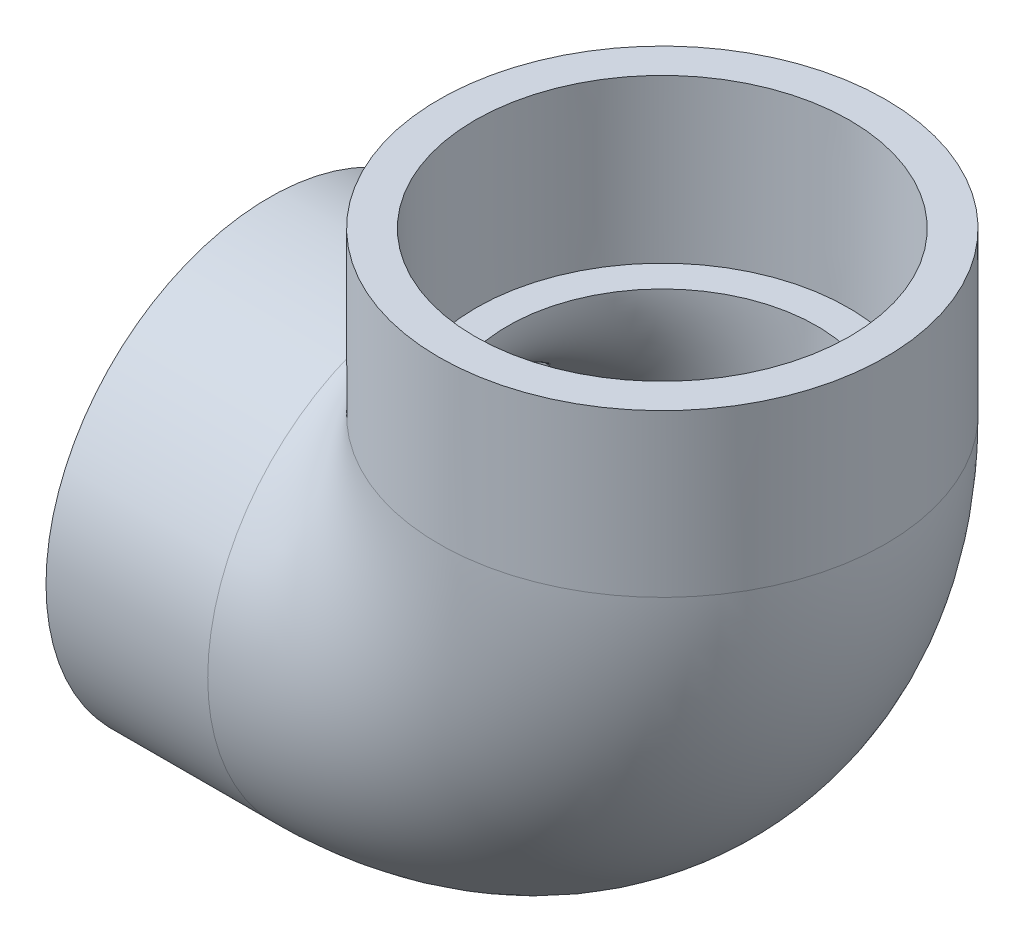
ISO-10303-21;
HEADER;
FILE_DESCRIPTION(('STEP AP214'),'2;1');
FILE_NAME('part.step','',(''),(''),'','','');
FILE_SCHEMA(('AUTOMOTIVE_DESIGN { 1 0 10303 214 1 1 1 1 }'));
ENDSEC;
DATA;
#1=APPLICATION_CONTEXT('core data for automotive mechanical design processes');
#2=APPLICATION_PROTOCOL_DEFINITION('international standard','automotive_design',2000,#1);
#3=PRODUCT_CONTEXT('',#1,'mechanical');
#4=PRODUCT('Part','Part','',(#3));
#5=PRODUCT_RELATED_PRODUCT_CATEGORY('part','',(#4));
#6=PRODUCT_DEFINITION_FORMATION('','',#4);
#7=PRODUCT_DEFINITION_CONTEXT('part definition',#1,'design');
#8=PRODUCT_DEFINITION('design','',#6,#7);
#9=PRODUCT_DEFINITION_SHAPE('','',#8);
#10=(LENGTH_UNIT() NAMED_UNIT(*) SI_UNIT(.MILLI.,.METRE.));
#11=(NAMED_UNIT(*) PLANE_ANGLE_UNIT() SI_UNIT($,.RADIAN.));
#12=(NAMED_UNIT(*) SI_UNIT($,.STERADIAN.) SOLID_ANGLE_UNIT());
#13=UNCERTAINTY_MEASURE_WITH_UNIT(LENGTH_MEASURE(1.E-05),#10,'distance_accuracy_value','');
#14=(GEOMETRIC_REPRESENTATION_CONTEXT(3) GLOBAL_UNCERTAINTY_ASSIGNED_CONTEXT((#13)) GLOBAL_UNIT_ASSIGNED_CONTEXT((#10,
#11,#12)) REPRESENTATION_CONTEXT('',''));
#15=CARTESIAN_POINT('',(0.,0.,0.));
#16=DIRECTION('',(0.,0.,1.));
#17=DIRECTION('',(1.,0.,0.));
#18=AXIS2_PLACEMENT_3D('',#15,#16,#17);
#19=CARTESIAN_POINT('',(-93.6625,-53.213,0.));
#20=DIRECTION('',(-1.,0.,0.));
#21=DIRECTION('',(0.,0.,1.));
#22=AXIS2_PLACEMENT_3D('',#19,#20,#21);
#23=PLANE('',#22);
#24=CARTESIAN_POINT('',(-93.6625,0.,0.));
#25=DIRECTION('',(-1.,0.,0.));
#26=DIRECTION('',(0.,0.,1.));
#27=AXIS2_PLACEMENT_3D('',#24,#25,#26);
#28=CIRCLE('',#27,53.213);
#29=CARTESIAN_POINT('',(-93.6625,0.,53.213));
#30=VERTEX_POINT('',#29);
#31=EDGE_CURVE('E51',#30,#30,#28,.T.);
#32=ORIENTED_EDGE('',*,*,#31,.T.);
#33=EDGE_LOOP('',(#32));
#34=FACE_BOUND('',#33,.T.);
#35=CARTESIAN_POINT('',(-93.6625,0.,0.));
#36=DIRECTION('',(-1.,0.,0.));
#37=DIRECTION('',(0.,0.,1.));
#38=AXIS2_PLACEMENT_3D('',#35,#36,#37);
#39=CIRCLE('',#38,44.6532);
#40=CARTESIAN_POINT('',(-93.6625,0.,44.6532));
#41=VERTEX_POINT('',#40);
#42=EDGE_CURVE('E38',#41,#41,#39,.T.);
#43=ORIENTED_EDGE('',*,*,#42,.F.);
#44=EDGE_LOOP('',(#43));
#45=FACE_BOUND('',#44,.T.);
#46=ADVANCED_FACE('F32',(#34,#45),#23,.T.);
#47=CARTESIAN_POINT('',(-55.118,0.,0.));
#48=DIRECTION('',(-1.,0.,0.));
#49=DIRECTION('',(0.,0.,1.));
#50=AXIS2_PLACEMENT_3D('',#47,#48,#49);
#51=CONICAL_SURFACE('',#50,44.3484,0.00790757817448898);
#52=ORIENTED_EDGE('',*,*,#42,.T.);
#53=EDGE_LOOP('',(#52));
#54=FACE_BOUND('',#53,.T.);
#55=CARTESIAN_POINT('',(-55.118,0.,0.));
#56=DIRECTION('',(-1.,0.,0.));
#57=DIRECTION('',(0.,0.,1.));
#58=AXIS2_PLACEMENT_3D('',#55,#56,#57);
#59=CIRCLE('',#58,44.3484);
#60=CARTESIAN_POINT('',(-55.118,0.,44.3484));
#61=VERTEX_POINT('',#60);
#62=EDGE_CURVE('E42',#61,#61,#59,.T.);
#63=ORIENTED_EDGE('',*,*,#62,.F.);
#64=EDGE_LOOP('',(#63));
#65=FACE_BOUND('',#64,.T.);
#66=ADVANCED_FACE('F83',(#54,#65),#51,.F.);
#67=CARTESIAN_POINT('',(-93.6625,0.,0.));
#68=DIRECTION('',(-1.,0.,0.));
#69=DIRECTION('',(0.,0.,1.));
#70=AXIS2_PLACEMENT_3D('',#67,#68,#69);
#71=CYLINDRICAL_SURFACE('',#70,53.213);
#72=CARTESIAN_POINT('',(-55.118,0.,0.));
#73=DIRECTION('',(-1.,0.,0.));
#74=DIRECTION('',(0.,0.,1.));
#75=AXIS2_PLACEMENT_3D('',#72,#73,#74);
#76=CIRCLE('',#75,53.213);
#77=CARTESIAN_POINT('',(-55.118,-53.213,0.));
#78=VERTEX_POINT('',#77);
#79=EDGE_CURVE('E46',#78,#78,#76,.T.);
#80=ORIENTED_EDGE('',*,*,#79,.T.);
#81=EDGE_LOOP('',(#80));
#82=FACE_BOUND('',#81,.T.);
#83=ORIENTED_EDGE('',*,*,#31,.F.);
#84=EDGE_LOOP('',(#83));
#85=FACE_BOUND('',#84,.T.);
#86=ADVANCED_FACE('F88',(#82,#85),#71,.T.);
#87=CARTESIAN_POINT('',(-55.118,55.118,0.));
#88=DIRECTION('',(0.,0.,-1.));
#89=DIRECTION('',(-1.,0.,0.));
#90=AXIS2_PLACEMENT_3D('',#87,#88,#89);
#91=TOROIDAL_SURFACE('',#90,55.118,36.83);
#92=CARTESIAN_POINT('',(0.,55.118,0.));
#93=DIRECTION('',(0.,1.,0.));
#94=DIRECTION('',(0.,0.,-1.));
#95=AXIS2_PLACEMENT_3D('',#92,#93,#94);
#96=CIRCLE('',#95,36.83);
#97=CARTESIAN_POINT('',(36.83,55.118,0.));
#98=VERTEX_POINT('',#97);
#99=EDGE_CURVE('E57',#98,#98,#96,.T.);
#100=CARTESIAN_POINT('',(-55.118,0.,0.));
#101=DIRECTION('',(1.,0.,0.));
#102=DIRECTION('',(0.,0.,-1.));
#103=AXIS2_PLACEMENT_3D('',#100,#101,#102);
#104=CIRCLE('',#103,36.83);
#105=CARTESIAN_POINT('',(-55.118,-36.83,0.));
#106=VERTEX_POINT('',#105);
#107=EDGE_CURVE('E60',#106,#106,#104,.T.);
#108=CARTESIAN_POINT('',(-55.118,55.118,0.));
#109=DIRECTION('',(0.,0.,-1.));
#110=DIRECTION('',(-1.,0.,0.));
#111=AXIS2_PLACEMENT_3D('',#108,#109,#110);
#112=CIRCLE('',#111,91.948);
#113=EDGE_CURVE('',#98,#106,#112,.T.);
#114=ORIENTED_EDGE('',*,*,#99,.T.);
#115=ORIENTED_EDGE('',*,*,#107,.F.);
#116=ORIENTED_EDGE('',*,*,#113,.T.);
#117=ORIENTED_EDGE('',*,*,#113,.F.);
#118=EDGE_LOOP('',(#114,#116,#115,#117));
#119=FACE_BOUND('',#118,.T.);
#120=ADVANCED_FACE('F93',(#119),#91,.F.);
#121=CARTESIAN_POINT('',(-55.118,55.118,0.));
#122=DIRECTION('',(0.,0.,-1.));
#123=DIRECTION('',(-1.,0.,0.));
#124=AXIS2_PLACEMENT_3D('',#121,#122,#123);
#125=TOROIDAL_SURFACE('',#124,55.118,53.213);
#126=CARTESIAN_POINT('',(0.,55.118,0.));
#127=DIRECTION('',(0.,1.,0.));
#128=DIRECTION('',(0.,0.,-1.));
#129=AXIS2_PLACEMENT_3D('',#126,#127,#128);
#130=CIRCLE('',#129,53.213);
#131=CARTESIAN_POINT('',(53.213,55.118,0.));
#132=VERTEX_POINT('',#131);
#133=EDGE_CURVE('E54',#132,#132,#130,.T.);
#134=CARTESIAN_POINT('',(-55.118,55.118,0.));
#135=DIRECTION('',(0.,0.,-1.));
#136=DIRECTION('',(-1.,0.,0.));
#137=AXIS2_PLACEMENT_3D('',#134,#135,#136);
#138=CIRCLE('',#137,108.331);
#139=EDGE_CURVE('',#132,#78,#138,.T.);
#140=ORIENTED_EDGE('',*,*,#133,.F.);
#141=ORIENTED_EDGE('',*,*,#79,.F.);
#142=ORIENTED_EDGE('',*,*,#139,.T.);
#143=ORIENTED_EDGE('',*,*,#139,.F.);
#144=EDGE_LOOP('',(#140,#142,#141,#143));
#145=FACE_BOUND('',#144,.T.);
#146=ADVANCED_FACE('F99',(#145),#125,.T.);
#147=CARTESIAN_POINT('',(0.,55.118,0.));
#148=DIRECTION('',(0.,1.,0.));
#149=DIRECTION('',(0.,0.,-1.));
#150=AXIS2_PLACEMENT_3D('',#147,#148,#149);
#151=PLANE('',#150);
#152=CARTESIAN_POINT('',(0.,55.118,0.));
#153=DIRECTION('',(0.,1.,0.));
#154=DIRECTION('',(-1.,0.,0.));
#155=AXIS2_PLACEMENT_3D('',#152,#153,#154);
#156=CIRCLE('',#155,44.3484);
#157=CARTESIAN_POINT('',(-44.3484,55.118,0.));
#158=VERTEX_POINT('',#157);
#159=EDGE_CURVE('E10',#158,#158,#156,.F.);
#160=ORIENTED_EDGE('',*,*,#159,.F.);
#161=EDGE_LOOP('',(#160));
#162=FACE_BOUND('',#161,.T.);
#163=ORIENTED_EDGE('',*,*,#99,.F.);
#164=EDGE_LOOP('',(#163));
#165=FACE_BOUND('',#164,.T.);
#166=ADVANCED_FACE('F104',(#162,#165),#151,.T.);
#167=CARTESIAN_POINT('',(-55.118,0.,0.));
#168=DIRECTION('',(1.,0.,0.));
#169=DIRECTION('',(0.,0.,-1.));
#170=AXIS2_PLACEMENT_3D('',#167,#168,#169);
#171=PLANE('',#170);
#172=ORIENTED_EDGE('',*,*,#62,.T.);
#173=EDGE_LOOP('',(#172));
#174=FACE_BOUND('',#173,.T.);
#175=ORIENTED_EDGE('',*,*,#107,.T.);
#176=EDGE_LOOP('',(#175));
#177=FACE_BOUND('',#176,.T.);
#178=ADVANCED_FACE('F109',(#174,#177),#171,.F.);
#179=CARTESIAN_POINT('',(53.213,93.6625,0.));
#180=DIRECTION('',(0.,1.,0.));
#181=DIRECTION('',(0.,0.,1.));
#182=AXIS2_PLACEMENT_3D('',#179,#180,#181);
#183=PLANE('',#182);
#184=CARTESIAN_POINT('',(0.,93.6625,0.));
#185=DIRECTION('',(0.,-1.,0.));
#186=DIRECTION('',(0.,0.,-1.));
#187=AXIS2_PLACEMENT_3D('',#184,#185,#186);
#188=CIRCLE('',#187,44.6532);
#189=CARTESIAN_POINT('',(0.,93.6625,-44.6532));
#190=VERTEX_POINT('',#189);
#191=EDGE_CURVE('E66',#190,#190,#188,.T.);
#192=ORIENTED_EDGE('',*,*,#191,.T.);
#193=EDGE_LOOP('',(#192));
#194=FACE_BOUND('',#193,.T.);
#195=CARTESIAN_POINT('',(0.,93.6625,0.));
#196=DIRECTION('',(0.,-1.,0.));
#197=DIRECTION('',(0.,0.,-1.));
#198=AXIS2_PLACEMENT_3D('',#195,#196,#197);
#199=CIRCLE('',#198,53.213);
#200=CARTESIAN_POINT('',(0.,93.6625,-53.213));
#201=VERTEX_POINT('',#200);
#202=EDGE_CURVE('E63',#201,#201,#199,.T.);
#203=ORIENTED_EDGE('',*,*,#202,.F.);
#204=EDGE_LOOP('',(#203));
#205=FACE_BOUND('',#204,.T.);
#206=ADVANCED_FACE('F70',(#194,#205),#183,.T.);
#207=CARTESIAN_POINT('',(0.,0.,0.));
#208=DIRECTION('',(0.,-1.,0.));
#209=DIRECTION('',(0.,0.,-1.));
#210=AXIS2_PLACEMENT_3D('',#207,#208,#209);
#211=CYLINDRICAL_SURFACE('',#210,53.213);
#212=ORIENTED_EDGE('',*,*,#202,.T.);
#213=EDGE_LOOP('',(#212));
#214=FACE_BOUND('',#213,.T.);
#215=ORIENTED_EDGE('',*,*,#133,.T.);
#216=EDGE_LOOP('',(#215));
#217=FACE_BOUND('',#216,.T.);
#218=ADVANCED_FACE('F75',(#214,#217),#211,.T.);
#219=CARTESIAN_POINT('',(0.,93.6625,0.));
#220=DIRECTION('',(0.,1.,0.));
#221=DIRECTION('',(0.,0.,1.));
#222=AXIS2_PLACEMENT_3D('',#219,#220,#221);
#223=CONICAL_SURFACE('',#222,44.6532,0.00790757817448898);
#224=ORIENTED_EDGE('',*,*,#159,.T.);
#225=EDGE_LOOP('',(#224));
#226=FACE_BOUND('',#225,.T.);
#227=ORIENTED_EDGE('',*,*,#191,.F.);
#228=EDGE_LOOP('',(#227));
#229=FACE_BOUND('',#228,.T.);
#230=ADVANCED_FACE('F73',(#226,#229),#223,.F.);
#231=CLOSED_SHELL('',(#46,#66,#86,#120,#146,#166,#178,#206,#218,#230));
#232=MANIFOLD_SOLID_BREP('B2',#231);
#233=ADVANCED_BREP_SHAPE_REPRESENTATION('',(#18,#232),#14);
#234=SHAPE_DEFINITION_REPRESENTATION(#9,#233);
ENDSEC;
END-ISO-10303-21;
